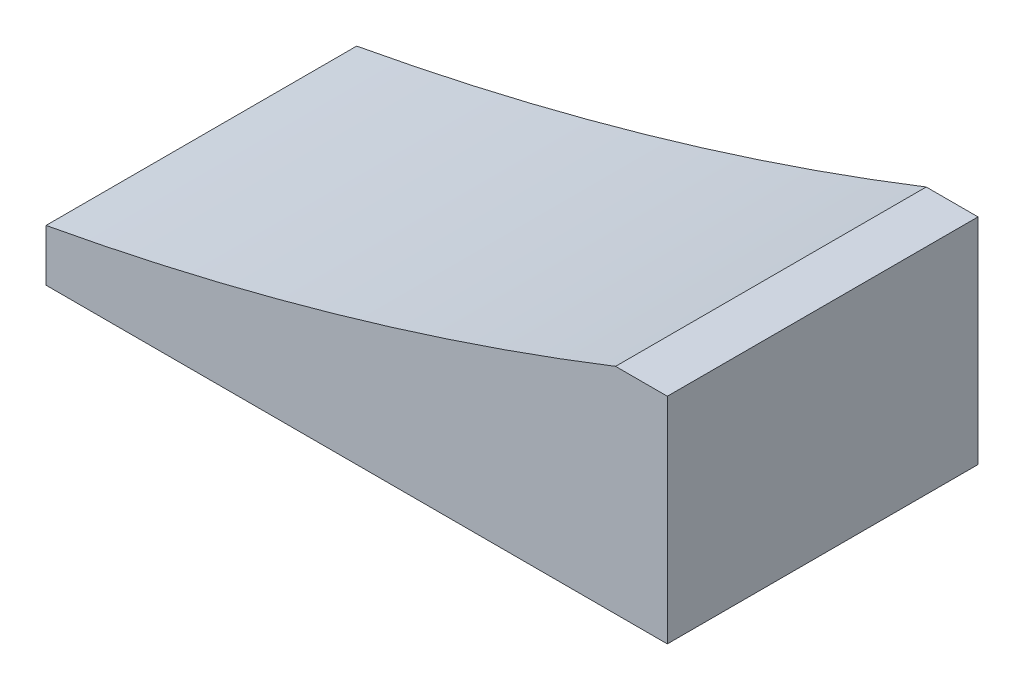
ISO-10303-21;
HEADER;
FILE_DESCRIPTION(('STEP AP214'),'2;1');
FILE_NAME('part.step','',(''),(''),'','','');
FILE_SCHEMA(('AUTOMOTIVE_DESIGN { 1 0 10303 214 1 1 1 1 }'));
ENDSEC;
DATA;
#1=APPLICATION_CONTEXT('core data for automotive mechanical design processes');
#2=APPLICATION_PROTOCOL_DEFINITION('international standard','automotive_design',2000,#1);
#3=PRODUCT_CONTEXT('',#1,'mechanical');
#4=PRODUCT('Part','Part','',(#3));
#5=PRODUCT_RELATED_PRODUCT_CATEGORY('part','',(#4));
#6=PRODUCT_DEFINITION_FORMATION('','',#4);
#7=PRODUCT_DEFINITION_CONTEXT('part definition',#1,'design');
#8=PRODUCT_DEFINITION('design','',#6,#7);
#9=PRODUCT_DEFINITION_SHAPE('','',#8);
#10=(LENGTH_UNIT() NAMED_UNIT(*) SI_UNIT(.MILLI.,.METRE.));
#11=(NAMED_UNIT(*) PLANE_ANGLE_UNIT() SI_UNIT($,.RADIAN.));
#12=(NAMED_UNIT(*) SI_UNIT($,.STERADIAN.) SOLID_ANGLE_UNIT());
#13=UNCERTAINTY_MEASURE_WITH_UNIT(LENGTH_MEASURE(1.E-05),#10,'distance_accuracy_value','');
#14=(GEOMETRIC_REPRESENTATION_CONTEXT(3) GLOBAL_UNCERTAINTY_ASSIGNED_CONTEXT((#13)) GLOBAL_UNIT_ASSIGNED_CONTEXT((#10,
#11,#12)) REPRESENTATION_CONTEXT('',''));
#15=CARTESIAN_POINT('',(0.,0.,0.));
#16=DIRECTION('',(0.,0.,1.));
#17=DIRECTION('',(1.,0.,0.));
#18=AXIS2_PLACEMENT_3D('',#15,#16,#17);
#19=CARTESIAN_POINT('',(0.,0.,30.));
#20=DIRECTION('',(0.,0.,-1.));
#21=DIRECTION('',(-1.,0.,0.));
#22=AXIS2_PLACEMENT_3D('',#19,#20,#21);
#23=CYLINDRICAL_SURFACE('',#22,300.);
#24=CARTESIAN_POINT('',(0.,0.,0.));
#25=DIRECTION('',(0.,0.,1.));
#26=DIRECTION('',(1.,0.,0.));
#27=AXIS2_PLACEMENT_3D('',#24,#25,#26);
#28=CIRCLE('',#27,300.);
#29=CARTESIAN_POINT('',(54.5435605731783,-295.,0.));
#30=VERTEX_POINT('',#29);
#31=CARTESIAN_POINT('',(109.543560573179,-279.285173858102,0.));
#32=VERTEX_POINT('',#31);
#33=EDGE_CURVE('E111',#30,#32,#28,.T.);
#34=ORIENTED_EDGE('',*,*,#33,.F.);
#35=DIRECTION('',(0.,0.,-1.));
#36=VECTOR('',#35,1.);
#37=CARTESIAN_POINT('',(54.5435605731783,-295.,30.));
#38=LINE('',#37,#36);
#39=CARTESIAN_POINT('',(54.5435605731783,-295.,30.));
#40=VERTEX_POINT('',#39);
#41=EDGE_CURVE('E11',#40,#30,#38,.T.);
#42=ORIENTED_EDGE('',*,*,#41,.F.);
#43=CARTESIAN_POINT('',(0.,0.,30.));
#44=DIRECTION('',(0.,0.,1.));
#45=DIRECTION('',(1.,0.,0.));
#46=AXIS2_PLACEMENT_3D('',#43,#44,#45);
#47=CIRCLE('',#46,300.);
#48=CARTESIAN_POINT('',(109.543560573179,-279.285173858102,30.));
#49=VERTEX_POINT('',#48);
#50=EDGE_CURVE('E120',#40,#49,#47,.T.);
#51=ORIENTED_EDGE('',*,*,#50,.T.);
#52=DIRECTION('',(0.,0.,-1.));
#53=VECTOR('',#52,1.);
#54=CARTESIAN_POINT('',(109.543560573179,-279.285173858102,30.));
#55=LINE('',#54,#53);
#56=EDGE_CURVE('E80',#49,#32,#55,.T.);
#57=ORIENTED_EDGE('',*,*,#56,.T.);
#58=EDGE_LOOP('',(#34,#42,#51,#57));
#59=FACE_BOUND('',#58,.T.);
#60=ADVANCED_FACE('F38',(#59),#23,.F.);
#61=CARTESIAN_POINT('',(54.5435605731783,0.,30.));
#62=DIRECTION('',(1.,0.,0.));
#63=DIRECTION('',(0.,0.,-1.));
#64=AXIS2_PLACEMENT_3D('',#61,#62,#63);
#65=PLANE('',#64);
#66=DIRECTION('',(0.,-1.,0.));
#67=VECTOR('',#66,1.);
#68=CARTESIAN_POINT('',(54.5435605731783,0.,0.));
#69=LINE('',#68,#67);
#70=CARTESIAN_POINT('',(54.5435605731783,-300.,0.));
#71=VERTEX_POINT('',#70);
#72=EDGE_CURVE('E114',#30,#71,#69,.T.);
#73=ORIENTED_EDGE('',*,*,#72,.T.);
#74=DIRECTION('',(0.,0.,-1.));
#75=VECTOR('',#74,1.);
#76=CARTESIAN_POINT('',(54.5435605731783,-300.,30.));
#77=LINE('',#76,#75);
#78=CARTESIAN_POINT('',(54.5435605731783,-300.,30.));
#79=VERTEX_POINT('',#78);
#80=EDGE_CURVE('E46',#79,#71,#77,.T.);
#81=ORIENTED_EDGE('',*,*,#80,.F.);
#82=DIRECTION('',(0.,-1.,0.));
#83=VECTOR('',#82,1.);
#84=CARTESIAN_POINT('',(54.5435605731783,0.,30.));
#85=LINE('',#84,#83);
#86=EDGE_CURVE('E95',#40,#79,#85,.T.);
#87=ORIENTED_EDGE('',*,*,#86,.F.);
#88=ORIENTED_EDGE('',*,*,#41,.T.);
#89=EDGE_LOOP('',(#73,#81,#87,#88));
#90=FACE_BOUND('',#89,.T.);
#91=ADVANCED_FACE('F131',(#90),#65,.F.);
#92=CARTESIAN_POINT('',(0.,-300.,30.));
#93=DIRECTION('',(0.,1.,0.));
#94=DIRECTION('',(0.,0.,1.));
#95=AXIS2_PLACEMENT_3D('',#92,#93,#94);
#96=PLANE('',#95);
#97=DIRECTION('',(1.,0.,0.));
#98=VECTOR('',#97,1.);
#99=CARTESIAN_POINT('',(0.,-300.,0.));
#100=LINE('',#99,#98);
#101=CARTESIAN_POINT('',(114.543560573179,-300.,0.));
#102=VERTEX_POINT('',#101);
#103=EDGE_CURVE('E103',#71,#102,#100,.T.);
#104=ORIENTED_EDGE('',*,*,#103,.T.);
#105=DIRECTION('',(0.,0.,-1.));
#106=VECTOR('',#105,1.);
#107=CARTESIAN_POINT('',(114.543560573179,-300.,30.));
#108=LINE('',#107,#106);
#109=CARTESIAN_POINT('',(114.543560573179,-300.,30.));
#110=VERTEX_POINT('',#109);
#111=EDGE_CURVE('E100',#110,#102,#108,.T.);
#112=ORIENTED_EDGE('',*,*,#111,.F.);
#113=DIRECTION('',(1.,0.,0.));
#114=VECTOR('',#113,1.);
#115=CARTESIAN_POINT('',(0.,-300.,30.));
#116=LINE('',#115,#114);
#117=EDGE_CURVE('E90',#79,#110,#116,.T.);
#118=ORIENTED_EDGE('',*,*,#117,.F.);
#119=ORIENTED_EDGE('',*,*,#80,.T.);
#120=EDGE_LOOP('',(#104,#112,#118,#119));
#121=FACE_BOUND('',#120,.T.);
#122=ADVANCED_FACE('F101',(#121),#96,.F.);
#123=CARTESIAN_POINT('',(114.543560573179,0.,30.));
#124=DIRECTION('',(-1.,0.,0.));
#125=DIRECTION('',(0.,0.,1.));
#126=AXIS2_PLACEMENT_3D('',#123,#124,#125);
#127=PLANE('',#126);
#128=DIRECTION('',(0.,1.,0.));
#129=VECTOR('',#128,1.);
#130=CARTESIAN_POINT('',(114.543560573179,0.,0.));
#131=LINE('',#130,#129);
#132=CARTESIAN_POINT('',(114.543560573179,-279.285173858102,0.));
#133=VERTEX_POINT('',#132);
#134=EDGE_CURVE('E73',#102,#133,#131,.T.);
#135=ORIENTED_EDGE('',*,*,#134,.T.);
#136=DIRECTION('',(0.,0.,-1.));
#137=VECTOR('',#136,1.);
#138=CARTESIAN_POINT('',(114.543560573179,-279.285173858102,30.));
#139=LINE('',#138,#137);
#140=CARTESIAN_POINT('',(114.543560573179,-279.285173858102,30.));
#141=VERTEX_POINT('',#140);
#142=EDGE_CURVE('E104',#141,#133,#139,.T.);
#143=ORIENTED_EDGE('',*,*,#142,.F.);
#144=DIRECTION('',(0.,1.,0.));
#145=VECTOR('',#144,1.);
#146=CARTESIAN_POINT('',(114.543560573179,0.,30.));
#147=LINE('',#146,#145);
#148=EDGE_CURVE('E94',#110,#141,#147,.T.);
#149=ORIENTED_EDGE('',*,*,#148,.F.);
#150=ORIENTED_EDGE('',*,*,#111,.T.);
#151=EDGE_LOOP('',(#135,#143,#149,#150));
#152=FACE_BOUND('',#151,.T.);
#153=ADVANCED_FACE('F106',(#152),#127,.F.);
#154=CARTESIAN_POINT('',(0.,-279.285173858102,30.));
#155=DIRECTION('',(0.,-1.,0.));
#156=DIRECTION('',(0.,0.,-1.));
#157=AXIS2_PLACEMENT_3D('',#154,#155,#156);
#158=PLANE('',#157);
#159=DIRECTION('',(-1.,0.,0.));
#160=VECTOR('',#159,1.);
#161=CARTESIAN_POINT('',(0.,-279.285173858102,0.));
#162=LINE('',#161,#160);
#163=EDGE_CURVE('E118',#133,#32,#162,.T.);
#164=ORIENTED_EDGE('',*,*,#163,.T.);
#165=ORIENTED_EDGE('',*,*,#56,.F.);
#166=DIRECTION('',(-1.,0.,0.));
#167=VECTOR('',#166,1.);
#168=CARTESIAN_POINT('',(0.,-279.285173858102,30.));
#169=LINE('',#168,#167);
#170=EDGE_CURVE('E54',#141,#49,#169,.T.);
#171=ORIENTED_EDGE('',*,*,#170,.F.);
#172=ORIENTED_EDGE('',*,*,#142,.T.);
#173=EDGE_LOOP('',(#164,#165,#171,#172));
#174=FACE_BOUND('',#173,.T.);
#175=ADVANCED_FACE('F128',(#174),#158,.F.);
#176=CARTESIAN_POINT('',(0.,0.,30.));
#177=DIRECTION('',(0.,0.,1.));
#178=DIRECTION('',(1.,0.,0.));
#179=AXIS2_PLACEMENT_3D('',#176,#177,#178);
#180=PLANE('',#179);
#181=ORIENTED_EDGE('',*,*,#50,.F.);
#182=ORIENTED_EDGE('',*,*,#86,.T.);
#183=ORIENTED_EDGE('',*,*,#117,.T.);
#184=ORIENTED_EDGE('',*,*,#148,.T.);
#185=ORIENTED_EDGE('',*,*,#170,.T.);
#186=EDGE_LOOP('',(#181,#182,#183,#184,#185));
#187=FACE_BOUND('',#186,.T.);
#188=ADVANCED_FACE('F92',(#187),#180,.T.);
#189=CARTESIAN_POINT('',(0.,0.,0.));
#190=DIRECTION('',(0.,0.,1.));
#191=DIRECTION('',(1.,0.,0.));
#192=AXIS2_PLACEMENT_3D('',#189,#190,#191);
#193=PLANE('',#192);
#194=ORIENTED_EDGE('',*,*,#33,.T.);
#195=ORIENTED_EDGE('',*,*,#163,.F.);
#196=ORIENTED_EDGE('',*,*,#134,.F.);
#197=ORIENTED_EDGE('',*,*,#103,.F.);
#198=ORIENTED_EDGE('',*,*,#72,.F.);
#199=EDGE_LOOP('',(#194,#195,#196,#197,#198));
#200=FACE_BOUND('',#199,.T.);
#201=ADVANCED_FACE('F125',(#200),#193,.F.);
#202=CLOSED_SHELL('',(#60,#91,#122,#153,#175,#188,#201));
#203=MANIFOLD_SOLID_BREP('B2',#202);
#204=ADVANCED_BREP_SHAPE_REPRESENTATION('',(#18,#203),#14);
#205=SHAPE_DEFINITION_REPRESENTATION(#9,#204);
ENDSEC;
END-ISO-10303-21;
